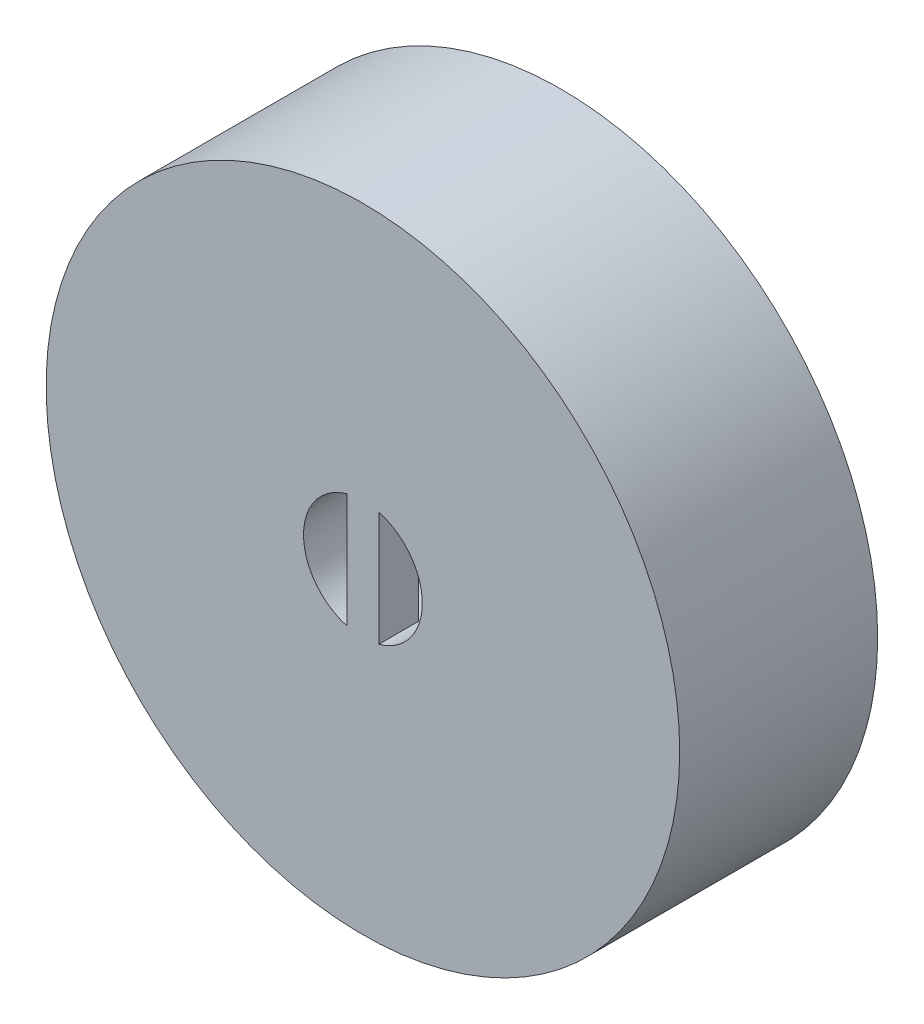
ISO-10303-21;
HEADER;
FILE_DESCRIPTION(('STEP AP214'),'2;1');
FILE_NAME('part.step','',(''),(''),'','','');
FILE_SCHEMA(('AUTOMOTIVE_DESIGN { 1 0 10303 214 1 1 1 1 }'));
ENDSEC;
DATA;
#1=APPLICATION_CONTEXT('core data for automotive mechanical design processes');
#2=APPLICATION_PROTOCOL_DEFINITION('international standard','automotive_design',2000,#1);
#3=PRODUCT_CONTEXT('',#1,'mechanical');
#4=PRODUCT('Part','Part','',(#3));
#5=PRODUCT_RELATED_PRODUCT_CATEGORY('part','',(#4));
#6=PRODUCT_DEFINITION_FORMATION('','',#4);
#7=PRODUCT_DEFINITION_CONTEXT('part definition',#1,'design');
#8=PRODUCT_DEFINITION('design','',#6,#7);
#9=PRODUCT_DEFINITION_SHAPE('','',#8);
#10=(LENGTH_UNIT() NAMED_UNIT(*) SI_UNIT(.MILLI.,.METRE.));
#11=(NAMED_UNIT(*) PLANE_ANGLE_UNIT() SI_UNIT($,.RADIAN.));
#12=(NAMED_UNIT(*) SI_UNIT($,.STERADIAN.) SOLID_ANGLE_UNIT());
#13=UNCERTAINTY_MEASURE_WITH_UNIT(LENGTH_MEASURE(1.E-05),#10,'distance_accuracy_value','');
#14=(GEOMETRIC_REPRESENTATION_CONTEXT(3) GLOBAL_UNCERTAINTY_ASSIGNED_CONTEXT((#13)) GLOBAL_UNIT_ASSIGNED_CONTEXT((#10,
#11,#12)) REPRESENTATION_CONTEXT('',''));
#15=CARTESIAN_POINT('',(0.,0.,0.));
#16=DIRECTION('',(0.,0.,1.));
#17=DIRECTION('',(1.,0.,0.));
#18=AXIS2_PLACEMENT_3D('',#15,#16,#17);
#19=CARTESIAN_POINT('',(0.,0.,15.875));
#20=DIRECTION('',(0.,0.,-1.));
#21=DIRECTION('',(-1.,0.,0.));
#22=AXIS2_PLACEMENT_3D('',#19,#20,#21);
#23=CYLINDRICAL_SURFACE('',#22,25.4);
#24=CARTESIAN_POINT('',(0.,0.,15.875));
#25=DIRECTION('',(0.,0.,1.));
#26=DIRECTION('',(1.,0.,0.));
#27=AXIS2_PLACEMENT_3D('',#24,#25,#26);
#28=CIRCLE('',#27,25.4);
#29=CARTESIAN_POINT('',(25.4,0.,15.875));
#30=VERTEX_POINT('',#29);
#31=EDGE_CURVE('E114',#30,#30,#28,.T.);
#32=ORIENTED_EDGE('',*,*,#31,.F.);
#33=EDGE_LOOP('',(#32));
#34=FACE_BOUND('',#33,.T.);
#35=CARTESIAN_POINT('',(0.,0.,0.));
#36=DIRECTION('',(0.,0.,1.));
#37=DIRECTION('',(1.,0.,0.));
#38=AXIS2_PLACEMENT_3D('',#35,#36,#37);
#39=CIRCLE('',#38,25.4);
#40=CARTESIAN_POINT('',(25.4,0.,0.));
#41=VERTEX_POINT('',#40);
#42=EDGE_CURVE('E113',#41,#41,#39,.T.);
#43=ORIENTED_EDGE('',*,*,#42,.T.);
#44=EDGE_LOOP('',(#43));
#45=FACE_BOUND('',#44,.T.);
#46=ADVANCED_FACE('F38',(#34,#45),#23,.T.);
#47=CARTESIAN_POINT('',(0.,0.,15.875));
#48=DIRECTION('',(0.,0.,-1.));
#49=DIRECTION('',(-1.,0.,0.));
#50=AXIS2_PLACEMENT_3D('',#47,#48,#49);
#51=CYLINDRICAL_SURFACE('',#50,4.7625);
#52=DIRECTION('',(0.,0.,1.));
#53=VECTOR('',#52,1.);
#54=CARTESIAN_POINT('',(1.27,4.5900442535993,12.7));
#55=LINE('',#54,#53);
#56=CARTESIAN_POINT('',(1.27,4.5900442535993,12.7));
#57=VERTEX_POINT('',#56);
#58=CARTESIAN_POINT('',(1.27,4.5900442535993,15.875));
#59=VERTEX_POINT('',#58);
#60=EDGE_CURVE('E58',#57,#59,#55,.T.);
#61=ORIENTED_EDGE('',*,*,#60,.F.);
#62=CARTESIAN_POINT('',(0.,0.,12.7));
#63=DIRECTION('',(0.,0.,1.));
#64=DIRECTION('',(1.,0.,0.));
#65=AXIS2_PLACEMENT_3D('',#62,#63,#64);
#66=CIRCLE('',#65,4.7625);
#67=CARTESIAN_POINT('',(-1.27,4.5900442535993,12.7));
#68=VERTEX_POINT('',#67);
#69=EDGE_CURVE('E53',#57,#68,#66,.T.);
#70=ORIENTED_EDGE('',*,*,#69,.T.);
#71=DIRECTION('',(0.,0.,1.));
#72=VECTOR('',#71,1.);
#73=CARTESIAN_POINT('',(-1.27,4.5900442535993,12.7));
#74=LINE('',#73,#72);
#75=CARTESIAN_POINT('',(-1.27,4.5900442535993,15.875));
#76=VERTEX_POINT('',#75);
#77=EDGE_CURVE('E85',#68,#76,#74,.T.);
#78=ORIENTED_EDGE('',*,*,#77,.T.);
#79=CARTESIAN_POINT('',(0.,0.,15.875));
#80=DIRECTION('',(0.,0.,1.));
#81=DIRECTION('',(1.,0.,0.));
#82=AXIS2_PLACEMENT_3D('',#79,#80,#81);
#83=CIRCLE('',#82,4.7625);
#84=CARTESIAN_POINT('',(-1.27,-4.5900442535993,15.875));
#85=VERTEX_POINT('',#84);
#86=EDGE_CURVE('E77',#76,#85,#83,.T.);
#87=ORIENTED_EDGE('',*,*,#86,.T.);
#88=DIRECTION('',(0.,0.,1.));
#89=VECTOR('',#88,1.);
#90=CARTESIAN_POINT('',(-1.27,-4.5900442535993,12.7));
#91=LINE('',#90,#89);
#92=CARTESIAN_POINT('',(-1.27,-4.5900442535993,12.7));
#93=VERTEX_POINT('',#92);
#94=EDGE_CURVE('E91',#93,#85,#91,.T.);
#95=ORIENTED_EDGE('',*,*,#94,.F.);
#96=CARTESIAN_POINT('',(0.,0.,12.7));
#97=DIRECTION('',(0.,0.,1.));
#98=DIRECTION('',(1.,0.,0.));
#99=AXIS2_PLACEMENT_3D('',#96,#97,#98);
#100=CIRCLE('',#99,4.7625);
#101=CARTESIAN_POINT('',(1.27,-4.5900442535993,12.7));
#102=VERTEX_POINT('',#101);
#103=EDGE_CURVE('E168',#93,#102,#100,.T.);
#104=ORIENTED_EDGE('',*,*,#103,.T.);
#105=DIRECTION('',(0.,0.,1.));
#106=VECTOR('',#105,1.);
#107=CARTESIAN_POINT('',(1.27,-4.59004425359931,12.7));
#108=LINE('',#107,#106);
#109=CARTESIAN_POINT('',(1.27,-4.59004425359931,15.875));
#110=VERTEX_POINT('',#109);
#111=EDGE_CURVE('E104',#102,#110,#108,.T.);
#112=ORIENTED_EDGE('',*,*,#111,.T.);
#113=EDGE_CURVE('E83',#110,#59,#83,.T.);
#114=ORIENTED_EDGE('',*,*,#113,.T.);
#115=EDGE_LOOP('',(#61,#70,#78,#87,#95,#104,#112,#114));
#116=FACE_BOUND('',#115,.T.);
#117=CARTESIAN_POINT('',(0.,0.,-9.525));
#118=DIRECTION('',(0.,0.,1.));
#119=DIRECTION('',(1.,0.,0.));
#120=AXIS2_PLACEMENT_3D('',#117,#118,#119);
#121=CIRCLE('',#120,4.7625);
#122=CARTESIAN_POINT('',(4.7625,0.,-9.525));
#123=VERTEX_POINT('',#122);
#124=EDGE_CURVE('E103',#123,#123,#121,.T.);
#125=ORIENTED_EDGE('',*,*,#124,.F.);
#126=EDGE_LOOP('',(#125));
#127=FACE_BOUND('',#126,.T.);
#128=ADVANCED_FACE('F86',(#116,#127),#51,.F.);
#129=CARTESIAN_POINT('',(0.,0.,15.875));
#130=DIRECTION('',(0.,0.,1.));
#131=DIRECTION('',(1.,0.,0.));
#132=AXIS2_PLACEMENT_3D('',#129,#130,#131);
#133=PLANE('',#132);
#134=ORIENTED_EDGE('',*,*,#86,.F.);
#135=DIRECTION('',(0.,-1.,0.));
#136=VECTOR('',#135,1.);
#137=CARTESIAN_POINT('',(-1.27,4.5900442535993,15.875));
#138=LINE('',#137,#136);
#139=EDGE_CURVE('E81',#76,#85,#138,.T.);
#140=ORIENTED_EDGE('',*,*,#139,.T.);
#141=EDGE_LOOP('',(#134,#140));
#142=FACE_BOUND('',#141,.T.);
#143=ORIENTED_EDGE('',*,*,#31,.T.);
#144=EDGE_LOOP('',(#143));
#145=FACE_BOUND('',#144,.T.);
#146=DIRECTION('',(0.,1.,0.));
#147=VECTOR('',#146,1.);
#148=CARTESIAN_POINT('',(1.27,4.5900442535993,15.875));
#149=LINE('',#148,#147);
#150=EDGE_CURVE('E95',#110,#59,#149,.T.);
#151=ORIENTED_EDGE('',*,*,#150,.T.);
#152=ORIENTED_EDGE('',*,*,#113,.F.);
#153=EDGE_LOOP('',(#151,#152));
#154=FACE_BOUND('',#153,.T.);
#155=ADVANCED_FACE('F78',(#142,#145,#154),#133,.T.);
#156=CARTESIAN_POINT('',(0.,0.,0.));
#157=DIRECTION('',(0.,0.,1.));
#158=DIRECTION('',(1.,0.,0.));
#159=AXIS2_PLACEMENT_3D('',#156,#157,#158);
#160=PLANE('',#159);
#161=CARTESIAN_POINT('',(0.,0.,0.));
#162=DIRECTION('',(0.,0.,1.));
#163=DIRECTION('',(1.,0.,0.));
#164=AXIS2_PLACEMENT_3D('',#161,#162,#163);
#165=CIRCLE('',#164,12.065);
#166=CARTESIAN_POINT('',(12.065,0.,0.));
#167=VERTEX_POINT('',#166);
#168=EDGE_CURVE('E46',#167,#167,#165,.T.);
#169=ORIENTED_EDGE('',*,*,#168,.T.);
#170=EDGE_LOOP('',(#169));
#171=FACE_BOUND('',#170,.T.);
#172=ORIENTED_EDGE('',*,*,#42,.F.);
#173=EDGE_LOOP('',(#172));
#174=FACE_BOUND('',#173,.T.);
#175=ADVANCED_FACE('F121',(#171,#174),#160,.F.);
#176=CARTESIAN_POINT('',(0.,0.,-9.525));
#177=DIRECTION('',(0.,0.,1.));
#178=DIRECTION('',(1.,0.,0.));
#179=AXIS2_PLACEMENT_3D('',#176,#177,#178);
#180=CYLINDRICAL_SURFACE('',#179,9.525);
#181=CARTESIAN_POINT('',(0.,0.,-2.54));
#182=DIRECTION('',(0.,0.,1.));
#183=DIRECTION('',(1.,0.,0.));
#184=AXIS2_PLACEMENT_3D('',#181,#182,#183);
#185=CIRCLE('',#184,9.525);
#186=CARTESIAN_POINT('',(9.525,0.,-2.54));
#187=VERTEX_POINT('',#186);
#188=EDGE_CURVE('E11',#187,#187,#185,.F.);
#189=ORIENTED_EDGE('',*,*,#188,.T.);
#190=EDGE_LOOP('',(#189));
#191=FACE_BOUND('',#190,.T.);
#192=CARTESIAN_POINT('',(0.,0.,-9.525));
#193=DIRECTION('',(0.,0.,1.));
#194=DIRECTION('',(1.,0.,0.));
#195=AXIS2_PLACEMENT_3D('',#192,#193,#194);
#196=CIRCLE('',#195,9.525);
#197=CARTESIAN_POINT('',(9.525,0.,-9.525));
#198=VERTEX_POINT('',#197);
#199=EDGE_CURVE('E110',#198,#198,#196,.T.);
#200=ORIENTED_EDGE('',*,*,#199,.T.);
#201=EDGE_LOOP('',(#200));
#202=FACE_BOUND('',#201,.T.);
#203=ADVANCED_FACE('F134',(#191,#202),#180,.T.);
#204=CARTESIAN_POINT('',(0.,0.,-9.525));
#205=DIRECTION('',(0.,0.,1.));
#206=DIRECTION('',(1.,0.,0.));
#207=AXIS2_PLACEMENT_3D('',#204,#205,#206);
#208=PLANE('',#207);
#209=ORIENTED_EDGE('',*,*,#124,.T.);
#210=EDGE_LOOP('',(#209));
#211=FACE_BOUND('',#210,.T.);
#212=ORIENTED_EDGE('',*,*,#199,.F.);
#213=EDGE_LOOP('',(#212));
#214=FACE_BOUND('',#213,.T.);
#215=ADVANCED_FACE('F126',(#211,#214),#208,.F.);
#216=CARTESIAN_POINT('',(0.,0.,-2.54));
#217=DIRECTION('',(0.,0.,1.));
#218=DIRECTION('',(1.,0.,0.));
#219=AXIS2_PLACEMENT_3D('',#216,#217,#218);
#220=TOROIDAL_SURFACE('',#219,12.065,2.54);
#221=ORIENTED_EDGE('',*,*,#188,.F.);
#222=EDGE_LOOP('',(#221));
#223=FACE_BOUND('',#222,.T.);
#224=ORIENTED_EDGE('',*,*,#168,.F.);
#225=EDGE_LOOP('',(#224));
#226=FACE_BOUND('',#225,.T.);
#227=ADVANCED_FACE('F40',(#223,#226),#220,.F.);
#228=CARTESIAN_POINT('',(1.27,4.5900442535993,12.7));
#229=DIRECTION('',(1.,0.,0.));
#230=DIRECTION('',(0.,0.,-1.));
#231=AXIS2_PLACEMENT_3D('',#228,#229,#230);
#232=PLANE('',#231);
#233=ORIENTED_EDGE('',*,*,#150,.F.);
#234=ORIENTED_EDGE('',*,*,#111,.F.);
#235=DIRECTION('',(0.,1.,0.));
#236=VECTOR('',#235,1.);
#237=CARTESIAN_POINT('',(1.27,4.5900442535993,12.7));
#238=LINE('',#237,#236);
#239=EDGE_CURVE('E92',#102,#57,#238,.T.);
#240=ORIENTED_EDGE('',*,*,#239,.T.);
#241=ORIENTED_EDGE('',*,*,#60,.T.);
#242=EDGE_LOOP('',(#233,#234,#240,#241));
#243=FACE_BOUND('',#242,.T.);
#244=ADVANCED_FACE('F125',(#243),#232,.T.);
#245=CARTESIAN_POINT('',(-1.27,4.5900442535993,12.7));
#246=DIRECTION('',(-1.,0.,0.));
#247=DIRECTION('',(0.,0.,1.));
#248=AXIS2_PLACEMENT_3D('',#245,#246,#247);
#249=PLANE('',#248);
#250=ORIENTED_EDGE('',*,*,#139,.F.);
#251=ORIENTED_EDGE('',*,*,#77,.F.);
#252=DIRECTION('',(0.,-1.,0.));
#253=VECTOR('',#252,1.);
#254=CARTESIAN_POINT('',(-1.27,4.5900442535993,12.7));
#255=LINE('',#254,#253);
#256=EDGE_CURVE('E164',#68,#93,#255,.T.);
#257=ORIENTED_EDGE('',*,*,#256,.T.);
#258=ORIENTED_EDGE('',*,*,#94,.T.);
#259=EDGE_LOOP('',(#250,#251,#257,#258));
#260=FACE_BOUND('',#259,.T.);
#261=ADVANCED_FACE('F94',(#260),#249,.T.);
#262=CARTESIAN_POINT('',(0.,0.,12.7));
#263=DIRECTION('',(0.,0.,1.));
#264=DIRECTION('',(1.,0.,0.));
#265=AXIS2_PLACEMENT_3D('',#262,#263,#264);
#266=PLANE('',#265);
#267=ORIENTED_EDGE('',*,*,#69,.F.);
#268=ORIENTED_EDGE('',*,*,#239,.F.);
#269=ORIENTED_EDGE('',*,*,#103,.F.);
#270=ORIENTED_EDGE('',*,*,#256,.F.);
#271=EDGE_LOOP('',(#267,#268,#269,#270));
#272=FACE_BOUND('',#271,.T.);
#273=ADVANCED_FACE('F155',(#272),#266,.F.);
#274=CLOSED_SHELL('',(#46,#128,#155,#175,#203,#215,#227,#244,#261,#273));
#275=MANIFOLD_SOLID_BREP('B2',#274);
#276=ADVANCED_BREP_SHAPE_REPRESENTATION('',(#18,#275),#14);
#277=SHAPE_DEFINITION_REPRESENTATION(#9,#276);
ENDSEC;
END-ISO-10303-21;
